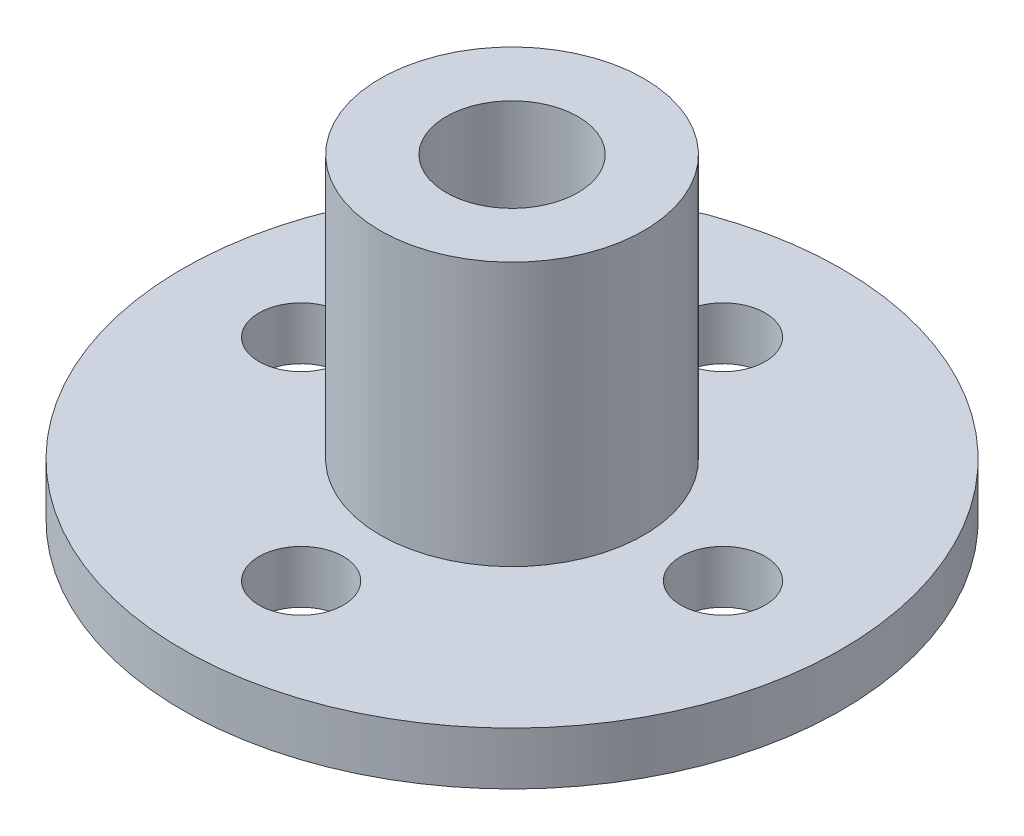
ISO-10303-21;
HEADER;
FILE_DESCRIPTION(('STEP AP214'),'2;1');
FILE_NAME('part.step','',(''),(''),'','','');
FILE_SCHEMA(('AUTOMOTIVE_DESIGN { 1 0 10303 214 1 1 1 1 }'));
ENDSEC;
DATA;
#1=APPLICATION_CONTEXT('core data for automotive mechanical design processes');
#2=APPLICATION_PROTOCOL_DEFINITION('international standard','automotive_design',2000,#1);
#3=PRODUCT_CONTEXT('',#1,'mechanical');
#4=PRODUCT('Part','Part','',(#3));
#5=PRODUCT_RELATED_PRODUCT_CATEGORY('part','',(#4));
#6=PRODUCT_DEFINITION_FORMATION('','',#4);
#7=PRODUCT_DEFINITION_CONTEXT('part definition',#1,'design');
#8=PRODUCT_DEFINITION('design','',#6,#7);
#9=PRODUCT_DEFINITION_SHAPE('','',#8);
#10=(LENGTH_UNIT() NAMED_UNIT(*) SI_UNIT(.MILLI.,.METRE.));
#11=(NAMED_UNIT(*) PLANE_ANGLE_UNIT() SI_UNIT($,.RADIAN.));
#12=(NAMED_UNIT(*) SI_UNIT($,.STERADIAN.) SOLID_ANGLE_UNIT());
#13=UNCERTAINTY_MEASURE_WITH_UNIT(LENGTH_MEASURE(1.E-05),#10,'distance_accuracy_value','');
#14=(GEOMETRIC_REPRESENTATION_CONTEXT(3) GLOBAL_UNCERTAINTY_ASSIGNED_CONTEXT((#13)) GLOBAL_UNIT_ASSIGNED_CONTEXT((#10,
#11,#12)) REPRESENTATION_CONTEXT('',''));
#15=CARTESIAN_POINT('',(0.,0.,0.));
#16=DIRECTION('',(0.,0.,1.));
#17=DIRECTION('',(1.,0.,0.));
#18=AXIS2_PLACEMENT_3D('',#15,#16,#17);
#19=CARTESIAN_POINT('',(0.,0.,0.));
#20=DIRECTION('',(0.,-1.,0.));
#21=DIRECTION('',(0.,0.,-1.));
#22=AXIS2_PLACEMENT_3D('',#19,#20,#21);
#23=CYLINDRICAL_SURFACE('',#22,2.5);
#24=CARTESIAN_POINT('',(0.,12.0139670732778,0.));
#25=DIRECTION('',(0.,-1.,0.));
#26=DIRECTION('',(0.,0.,-1.));
#27=AXIS2_PLACEMENT_3D('',#24,#25,#26);
#28=CIRCLE('',#27,2.5);
#29=CARTESIAN_POINT('',(0.,12.0139670732778,-2.5));
#30=VERTEX_POINT('',#29);
#31=EDGE_CURVE('E60',#30,#30,#28,.T.);
#32=ORIENTED_EDGE('',*,*,#31,.F.);
#33=EDGE_LOOP('',(#32));
#34=FACE_BOUND('',#33,.T.);
#35=CARTESIAN_POINT('',(0.,0.0139670732778081,0.));
#36=DIRECTION('',(0.,-1.,0.));
#37=DIRECTION('',(0.,0.,-1.));
#38=AXIS2_PLACEMENT_3D('',#35,#36,#37);
#39=CIRCLE('',#38,2.5);
#40=CARTESIAN_POINT('',(0.,0.0139670732778081,-2.5));
#41=VERTEX_POINT('',#40);
#42=EDGE_CURVE('E10',#41,#41,#39,.T.);
#43=ORIENTED_EDGE('',*,*,#42,.T.);
#44=EDGE_LOOP('',(#43));
#45=FACE_BOUND('',#44,.T.);
#46=ADVANCED_FACE('F33',(#34,#45),#23,.F.);
#47=CARTESIAN_POINT('',(-2.5,0.013967073277807,0.));
#48=DIRECTION('',(0.,1.,0.));
#49=DIRECTION('',(0.,0.,1.));
#50=AXIS2_PLACEMENT_3D('',#47,#48,#49);
#51=PLANE('',#50);
#52=CARTESIAN_POINT('',(-8.,0.013967073277807,0.));
#53=DIRECTION('',(0.,-1.,0.));
#54=DIRECTION('',(0.,0.,-1.));
#55=AXIS2_PLACEMENT_3D('',#52,#53,#54);
#56=CIRCLE('',#55,1.6);
#57=CARTESIAN_POINT('',(-8.,0.013967073277807,-1.6));
#58=VERTEX_POINT('',#57);
#59=EDGE_CURVE('E53',#58,#58,#56,.T.);
#60=ORIENTED_EDGE('',*,*,#59,.F.);
#61=EDGE_LOOP('',(#60));
#62=FACE_BOUND('',#61,.T.);
#63=CARTESIAN_POINT('',(0.,0.013967073277807,8.));
#64=DIRECTION('',(0.,-1.,0.));
#65=DIRECTION('',(0.,0.,-1.));
#66=AXIS2_PLACEMENT_3D('',#63,#64,#65);
#67=CIRCLE('',#66,1.6);
#68=CARTESIAN_POINT('',(0.,0.013967073277807,6.4));
#69=VERTEX_POINT('',#68);
#70=EDGE_CURVE('E121',#69,#69,#67,.T.);
#71=ORIENTED_EDGE('',*,*,#70,.F.);
#72=EDGE_LOOP('',(#71));
#73=FACE_BOUND('',#72,.T.);
#74=CARTESIAN_POINT('',(8.,0.013967073277807,0.));
#75=DIRECTION('',(0.,-1.,0.));
#76=DIRECTION('',(0.,0.,-1.));
#77=AXIS2_PLACEMENT_3D('',#74,#75,#76);
#78=CIRCLE('',#77,1.6);
#79=CARTESIAN_POINT('',(8.,0.013967073277807,-1.6));
#80=VERTEX_POINT('',#79);
#81=EDGE_CURVE('E125',#80,#80,#78,.T.);
#82=ORIENTED_EDGE('',*,*,#81,.F.);
#83=EDGE_LOOP('',(#82));
#84=FACE_BOUND('',#83,.T.);
#85=CARTESIAN_POINT('',(0.,0.013967073277807,-8.));
#86=DIRECTION('',(0.,-1.,0.));
#87=DIRECTION('',(0.,0.,-1.));
#88=AXIS2_PLACEMENT_3D('',#85,#86,#87);
#89=CIRCLE('',#88,1.6);
#90=CARTESIAN_POINT('',(0.,0.013967073277807,-9.6));
#91=VERTEX_POINT('',#90);
#92=EDGE_CURVE('E72',#91,#91,#89,.T.);
#93=ORIENTED_EDGE('',*,*,#92,.F.);
#94=EDGE_LOOP('',(#93));
#95=FACE_BOUND('',#94,.T.);
#96=ORIENTED_EDGE('',*,*,#42,.F.);
#97=EDGE_LOOP('',(#96));
#98=FACE_BOUND('',#97,.T.);
#99=CARTESIAN_POINT('',(0.,0.0139670732778058,0.));
#100=DIRECTION('',(0.,-1.,0.));
#101=DIRECTION('',(0.,0.,-1.));
#102=AXIS2_PLACEMENT_3D('',#99,#100,#101);
#103=CIRCLE('',#102,12.5);
#104=CARTESIAN_POINT('',(0.,0.0139670732778058,-12.5));
#105=VERTEX_POINT('',#104);
#106=EDGE_CURVE('E40',#105,#105,#103,.T.);
#107=ORIENTED_EDGE('',*,*,#106,.T.);
#108=EDGE_LOOP('',(#107));
#109=FACE_BOUND('',#108,.T.);
#110=ADVANCED_FACE('F104',(#62,#73,#84,#95,#98,#109),#51,.F.);
#111=CARTESIAN_POINT('',(0.,0.,0.));
#112=DIRECTION('',(0.,-1.,0.));
#113=DIRECTION('',(0.,0.,-1.));
#114=AXIS2_PLACEMENT_3D('',#111,#112,#113);
#115=CYLINDRICAL_SURFACE('',#114,12.5);
#116=ORIENTED_EDGE('',*,*,#106,.F.);
#117=EDGE_LOOP('',(#116));
#118=FACE_BOUND('',#117,.T.);
#119=CARTESIAN_POINT('',(0.,2.01396707327781,0.));
#120=DIRECTION('',(0.,-1.,0.));
#121=DIRECTION('',(0.,0.,-1.));
#122=AXIS2_PLACEMENT_3D('',#119,#120,#121);
#123=CIRCLE('',#122,12.5);
#124=CARTESIAN_POINT('',(0.,2.01396707327781,-12.5));
#125=VERTEX_POINT('',#124);
#126=EDGE_CURVE('E45',#125,#125,#123,.T.);
#127=ORIENTED_EDGE('',*,*,#126,.T.);
#128=EDGE_LOOP('',(#127));
#129=FACE_BOUND('',#128,.T.);
#130=ADVANCED_FACE('F79',(#118,#129),#115,.T.);
#131=CARTESIAN_POINT('',(-12.5,2.01396707327781,0.));
#132=DIRECTION('',(0.,-1.,0.));
#133=DIRECTION('',(0.,0.,-1.));
#134=AXIS2_PLACEMENT_3D('',#131,#132,#133);
#135=PLANE('',#134);
#136=CARTESIAN_POINT('',(-8.,2.01396707327781,0.));
#137=DIRECTION('',(0.,-1.,0.));
#138=DIRECTION('',(0.,0.,-1.));
#139=AXIS2_PLACEMENT_3D('',#136,#137,#138);
#140=CIRCLE('',#139,1.6);
#141=CARTESIAN_POINT('',(-8.,2.01396707327781,-1.6));
#142=VERTEX_POINT('',#141);
#143=EDGE_CURVE('E36',#142,#142,#140,.T.);
#144=ORIENTED_EDGE('',*,*,#143,.T.);
#145=EDGE_LOOP('',(#144));
#146=FACE_BOUND('',#145,.T.);
#147=CARTESIAN_POINT('',(0.,2.01396707327781,8.));
#148=DIRECTION('',(0.,-1.,0.));
#149=DIRECTION('',(0.,0.,-1.));
#150=AXIS2_PLACEMENT_3D('',#147,#148,#149);
#151=CIRCLE('',#150,1.6);
#152=CARTESIAN_POINT('',(0.,2.01396707327781,6.4));
#153=VERTEX_POINT('',#152);
#154=EDGE_CURVE('E55',#153,#153,#151,.T.);
#155=ORIENTED_EDGE('',*,*,#154,.T.);
#156=EDGE_LOOP('',(#155));
#157=FACE_BOUND('',#156,.T.);
#158=CARTESIAN_POINT('',(8.,2.01396707327781,0.));
#159=DIRECTION('',(0.,-1.,0.));
#160=DIRECTION('',(0.,0.,-1.));
#161=AXIS2_PLACEMENT_3D('',#158,#159,#160);
#162=CIRCLE('',#161,1.6);
#163=CARTESIAN_POINT('',(8.,2.01396707327781,-1.6));
#164=VERTEX_POINT('',#163);
#165=EDGE_CURVE('E52',#164,#164,#162,.T.);
#166=ORIENTED_EDGE('',*,*,#165,.T.);
#167=EDGE_LOOP('',(#166));
#168=FACE_BOUND('',#167,.T.);
#169=CARTESIAN_POINT('',(0.,2.01396707327781,-8.));
#170=DIRECTION('',(0.,-1.,0.));
#171=DIRECTION('',(0.,0.,-1.));
#172=AXIS2_PLACEMENT_3D('',#169,#170,#171);
#173=CIRCLE('',#172,1.6);
#174=CARTESIAN_POINT('',(0.,2.01396707327781,-9.6));
#175=VERTEX_POINT('',#174);
#176=EDGE_CURVE('E49',#175,#175,#173,.T.);
#177=ORIENTED_EDGE('',*,*,#176,.T.);
#178=EDGE_LOOP('',(#177));
#179=FACE_BOUND('',#178,.T.);
#180=ORIENTED_EDGE('',*,*,#126,.F.);
#181=EDGE_LOOP('',(#180));
#182=FACE_BOUND('',#181,.T.);
#183=CARTESIAN_POINT('',(0.,2.01396707327781,0.));
#184=DIRECTION('',(0.,-1.,0.));
#185=DIRECTION('',(0.,0.,-1.));
#186=AXIS2_PLACEMENT_3D('',#183,#184,#185);
#187=CIRCLE('',#186,5.);
#188=CARTESIAN_POINT('',(0.,2.01396707327781,-5.));
#189=VERTEX_POINT('',#188);
#190=EDGE_CURVE('E69',#189,#189,#187,.T.);
#191=ORIENTED_EDGE('',*,*,#190,.T.);
#192=EDGE_LOOP('',(#191));
#193=FACE_BOUND('',#192,.T.);
#194=ADVANCED_FACE('F81',(#146,#157,#168,#179,#182,#193),#135,.F.);
#195=CARTESIAN_POINT('',(0.,0.,0.));
#196=DIRECTION('',(0.,-1.,0.));
#197=DIRECTION('',(0.,0.,-1.));
#198=AXIS2_PLACEMENT_3D('',#195,#196,#197);
#199=CYLINDRICAL_SURFACE('',#198,5.);
#200=ORIENTED_EDGE('',*,*,#190,.F.);
#201=EDGE_LOOP('',(#200));
#202=FACE_BOUND('',#201,.T.);
#203=CARTESIAN_POINT('',(0.,12.0139670732778,0.));
#204=DIRECTION('',(0.,-1.,0.));
#205=DIRECTION('',(0.,0.,-1.));
#206=AXIS2_PLACEMENT_3D('',#203,#204,#205);
#207=CIRCLE('',#206,5.);
#208=CARTESIAN_POINT('',(0.,12.0139670732778,-5.));
#209=VERTEX_POINT('',#208);
#210=EDGE_CURVE('E64',#209,#209,#207,.T.);
#211=ORIENTED_EDGE('',*,*,#210,.T.);
#212=EDGE_LOOP('',(#211));
#213=FACE_BOUND('',#212,.T.);
#214=ADVANCED_FACE('F84',(#202,#213),#199,.T.);
#215=CARTESIAN_POINT('',(-5.,12.0139670732778,0.));
#216=DIRECTION('',(0.,-1.,0.));
#217=DIRECTION('',(0.,0.,-1.));
#218=AXIS2_PLACEMENT_3D('',#215,#216,#217);
#219=PLANE('',#218);
#220=ORIENTED_EDGE('',*,*,#210,.F.);
#221=EDGE_LOOP('',(#220));
#222=FACE_BOUND('',#221,.T.);
#223=ORIENTED_EDGE('',*,*,#31,.T.);
#224=EDGE_LOOP('',(#223));
#225=FACE_BOUND('',#224,.T.);
#226=ADVANCED_FACE('F90',(#222,#225),#219,.F.);
#227=CARTESIAN_POINT('',(0.,10.0139670732778,-8.));
#228=DIRECTION('',(0.,-1.,0.));
#229=DIRECTION('',(0.,0.,-1.));
#230=AXIS2_PLACEMENT_3D('',#227,#228,#229);
#231=CYLINDRICAL_SURFACE('',#230,1.6);
#232=ORIENTED_EDGE('',*,*,#92,.T.);
#233=EDGE_LOOP('',(#232));
#234=FACE_BOUND('',#233,.T.);
#235=ORIENTED_EDGE('',*,*,#176,.F.);
#236=EDGE_LOOP('',(#235));
#237=FACE_BOUND('',#236,.T.);
#238=ADVANCED_FACE('F95',(#234,#237),#231,.F.);
#239=CARTESIAN_POINT('',(8.,10.0139670732778,0.));
#240=DIRECTION('',(0.,-1.,0.));
#241=DIRECTION('',(0.,0.,-1.));
#242=AXIS2_PLACEMENT_3D('',#239,#240,#241);
#243=CYLINDRICAL_SURFACE('',#242,1.6);
#244=ORIENTED_EDGE('',*,*,#81,.T.);
#245=EDGE_LOOP('',(#244));
#246=FACE_BOUND('',#245,.T.);
#247=ORIENTED_EDGE('',*,*,#165,.F.);
#248=EDGE_LOOP('',(#247));
#249=FACE_BOUND('',#248,.T.);
#250=ADVANCED_FACE('F100',(#246,#249),#243,.F.);
#251=CARTESIAN_POINT('',(0.,10.0139670732778,8.));
#252=DIRECTION('',(0.,-1.,0.));
#253=DIRECTION('',(0.,0.,-1.));
#254=AXIS2_PLACEMENT_3D('',#251,#252,#253);
#255=CYLINDRICAL_SURFACE('',#254,1.6);
#256=ORIENTED_EDGE('',*,*,#70,.T.);
#257=EDGE_LOOP('',(#256));
#258=FACE_BOUND('',#257,.T.);
#259=ORIENTED_EDGE('',*,*,#154,.F.);
#260=EDGE_LOOP('',(#259));
#261=FACE_BOUND('',#260,.T.);
#262=ADVANCED_FACE('F138',(#258,#261),#255,.F.);
#263=CARTESIAN_POINT('',(-8.,10.0139670732778,0.));
#264=DIRECTION('',(0.,-1.,0.));
#265=DIRECTION('',(0.,0.,-1.));
#266=AXIS2_PLACEMENT_3D('',#263,#264,#265);
#267=CYLINDRICAL_SURFACE('',#266,1.6);
#268=ORIENTED_EDGE('',*,*,#59,.T.);
#269=EDGE_LOOP('',(#268));
#270=FACE_BOUND('',#269,.T.);
#271=ORIENTED_EDGE('',*,*,#143,.F.);
#272=EDGE_LOOP('',(#271));
#273=FACE_BOUND('',#272,.T.);
#274=ADVANCED_FACE('F135',(#270,#273),#267,.F.);
#275=CLOSED_SHELL('',(#46,#110,#130,#194,#214,#226,#238,#250,#262,#274));
#276=MANIFOLD_SOLID_BREP('B2',#275);
#277=ADVANCED_BREP_SHAPE_REPRESENTATION('',(#18,#276),#14);
#278=SHAPE_DEFINITION_REPRESENTATION(#9,#277);
ENDSEC;
END-ISO-10303-21;
